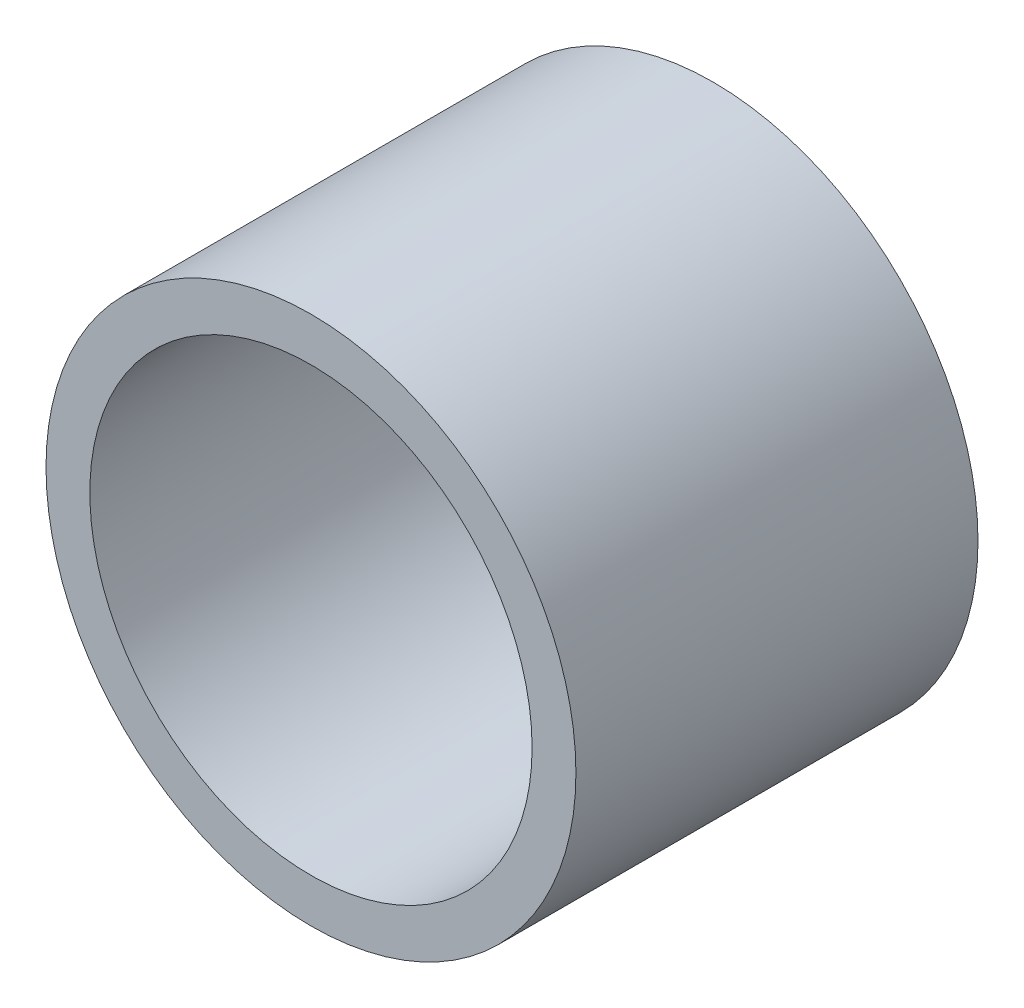
ISO-10303-21;
HEADER;
FILE_DESCRIPTION(('STEP AP214'),'2;1');
FILE_NAME('part.step','',(''),(''),'','','');
FILE_SCHEMA(('AUTOMOTIVE_DESIGN { 1 0 10303 214 1 1 1 1 }'));
ENDSEC;
DATA;
#1=APPLICATION_CONTEXT('core data for automotive mechanical design processes');
#2=APPLICATION_PROTOCOL_DEFINITION('international standard','automotive_design',2000,#1);
#3=PRODUCT_CONTEXT('',#1,'mechanical');
#4=PRODUCT('Part','Part','',(#3));
#5=PRODUCT_RELATED_PRODUCT_CATEGORY('part','',(#4));
#6=PRODUCT_DEFINITION_FORMATION('','',#4);
#7=PRODUCT_DEFINITION_CONTEXT('part definition',#1,'design');
#8=PRODUCT_DEFINITION('design','',#6,#7);
#9=PRODUCT_DEFINITION_SHAPE('','',#8);
#10=(LENGTH_UNIT() NAMED_UNIT(*) SI_UNIT(.MILLI.,.METRE.));
#11=(NAMED_UNIT(*) PLANE_ANGLE_UNIT() SI_UNIT($,.RADIAN.));
#12=(NAMED_UNIT(*) SI_UNIT($,.STERADIAN.) SOLID_ANGLE_UNIT());
#13=UNCERTAINTY_MEASURE_WITH_UNIT(LENGTH_MEASURE(1.E-05),#10,'distance_accuracy_value','');
#14=(GEOMETRIC_REPRESENTATION_CONTEXT(3) GLOBAL_UNCERTAINTY_ASSIGNED_CONTEXT((#13)) GLOBAL_UNIT_ASSIGNED_CONTEXT((#10,
#11,#12)) REPRESENTATION_CONTEXT('',''));
#15=CARTESIAN_POINT('',(0.,0.,0.));
#16=DIRECTION('',(0.,0.,1.));
#17=DIRECTION('',(1.,0.,0.));
#18=AXIS2_PLACEMENT_3D('',#15,#16,#17);
#19=CARTESIAN_POINT('',(0.,0.,50.));
#20=DIRECTION('',(0.,0.,1.));
#21=DIRECTION('',(1.,0.,0.));
#22=AXIS2_PLACEMENT_3D('',#19,#20,#21);
#23=PLANE('',#22);
#24=CARTESIAN_POINT('',(0.,0.,50.));
#25=DIRECTION('',(0.,0.,1.));
#26=DIRECTION('',(1.,0.,0.));
#27=AXIS2_PLACEMENT_3D('',#24,#25,#26);
#28=CIRCLE('',#27,32.95);
#29=CARTESIAN_POINT('',(32.95,0.,50.));
#30=VERTEX_POINT('',#29);
#31=EDGE_CURVE('E10',#30,#30,#28,.T.);
#32=ORIENTED_EDGE('',*,*,#31,.T.);
#33=EDGE_LOOP('',(#32));
#34=FACE_BOUND('',#33,.T.);
#35=CARTESIAN_POINT('',(0.,0.,50.));
#36=DIRECTION('',(0.,0.,1.));
#37=DIRECTION('',(1.,0.,0.));
#38=AXIS2_PLACEMENT_3D('',#35,#36,#37);
#39=CIRCLE('',#38,27.5);
#40=CARTESIAN_POINT('',(27.5,0.,50.));
#41=VERTEX_POINT('',#40);
#42=EDGE_CURVE('E45',#41,#41,#39,.T.);
#43=ORIENTED_EDGE('',*,*,#42,.F.);
#44=EDGE_LOOP('',(#43));
#45=FACE_BOUND('',#44,.T.);
#46=ADVANCED_FACE('F34',(#34,#45),#23,.T.);
#47=CARTESIAN_POINT('',(0.,0.,0.));
#48=DIRECTION('',(0.,0.,1.));
#49=DIRECTION('',(1.,0.,0.));
#50=AXIS2_PLACEMENT_3D('',#47,#48,#49);
#51=PLANE('',#50);
#52=CARTESIAN_POINT('',(0.,0.,0.));
#53=DIRECTION('',(0.,0.,1.));
#54=DIRECTION('',(1.,0.,0.));
#55=AXIS2_PLACEMENT_3D('',#52,#53,#54);
#56=CIRCLE('',#55,32.95);
#57=CARTESIAN_POINT('',(32.95,0.,0.));
#58=VERTEX_POINT('',#57);
#59=EDGE_CURVE('E38',#58,#58,#56,.T.);
#60=ORIENTED_EDGE('',*,*,#59,.F.);
#61=EDGE_LOOP('',(#60));
#62=FACE_BOUND('',#61,.T.);
#63=CARTESIAN_POINT('',(0.,0.,0.));
#64=DIRECTION('',(0.,0.,1.));
#65=DIRECTION('',(1.,0.,0.));
#66=AXIS2_PLACEMENT_3D('',#63,#64,#65);
#67=CIRCLE('',#66,27.5);
#68=CARTESIAN_POINT('',(27.5,0.,0.));
#69=VERTEX_POINT('',#68);
#70=EDGE_CURVE('E47',#69,#69,#67,.T.);
#71=ORIENTED_EDGE('',*,*,#70,.T.);
#72=EDGE_LOOP('',(#71));
#73=FACE_BOUND('',#72,.T.);
#74=ADVANCED_FACE('F57',(#62,#73),#51,.F.);
#75=CARTESIAN_POINT('',(0.,0.,50.));
#76=DIRECTION('',(0.,0.,-1.));
#77=DIRECTION('',(-1.,0.,0.));
#78=AXIS2_PLACEMENT_3D('',#75,#76,#77);
#79=CYLINDRICAL_SURFACE('',#78,32.95);
#80=ORIENTED_EDGE('',*,*,#31,.F.);
#81=EDGE_LOOP('',(#80));
#82=FACE_BOUND('',#81,.T.);
#83=ORIENTED_EDGE('',*,*,#59,.T.);
#84=EDGE_LOOP('',(#83));
#85=FACE_BOUND('',#84,.T.);
#86=ADVANCED_FACE('F36',(#82,#85),#79,.T.);
#87=CARTESIAN_POINT('',(0.,0.,50.));
#88=DIRECTION('',(0.,0.,-1.));
#89=DIRECTION('',(-1.,0.,0.));
#90=AXIS2_PLACEMENT_3D('',#87,#88,#89);
#91=CYLINDRICAL_SURFACE('',#90,27.5);
#92=ORIENTED_EDGE('',*,*,#42,.T.);
#93=EDGE_LOOP('',(#92));
#94=FACE_BOUND('',#93,.T.);
#95=ORIENTED_EDGE('',*,*,#70,.F.);
#96=EDGE_LOOP('',(#95));
#97=FACE_BOUND('',#96,.T.);
#98=ADVANCED_FACE('F53',(#94,#97),#91,.F.);
#99=CLOSED_SHELL('',(#46,#74,#86,#98));
#100=MANIFOLD_SOLID_BREP('B2',#99);
#101=ADVANCED_BREP_SHAPE_REPRESENTATION('',(#18,#100),#14);
#102=SHAPE_DEFINITION_REPRESENTATION(#9,#101);
ENDSEC;
END-ISO-10303-21;
